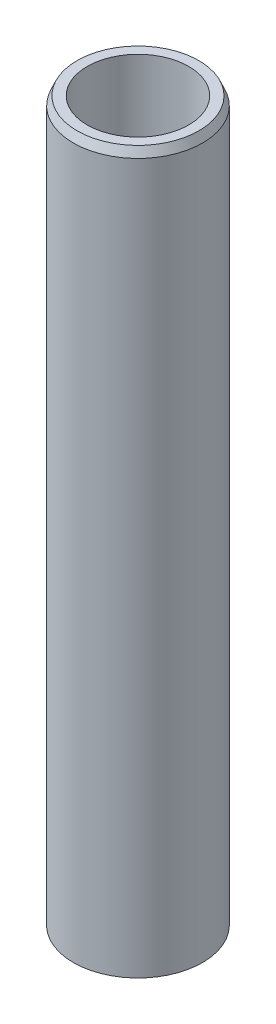
ISO-10303-21;
HEADER;
FILE_DESCRIPTION(('STEP AP214'),'2;1');
FILE_NAME('part.step','',(''),(''),'','','');
FILE_SCHEMA(('AUTOMOTIVE_DESIGN { 1 0 10303 214 1 1 1 1 }'));
ENDSEC;
DATA;
#1=APPLICATION_CONTEXT('core data for automotive mechanical design processes');
#2=APPLICATION_PROTOCOL_DEFINITION('international standard','automotive_design',2000,#1);
#3=PRODUCT_CONTEXT('',#1,'mechanical');
#4=PRODUCT('Part','Part','',(#3));
#5=PRODUCT_RELATED_PRODUCT_CATEGORY('part','',(#4));
#6=PRODUCT_DEFINITION_FORMATION('','',#4);
#7=PRODUCT_DEFINITION_CONTEXT('part definition',#1,'design');
#8=PRODUCT_DEFINITION('design','',#6,#7);
#9=PRODUCT_DEFINITION_SHAPE('','',#8);
#10=(LENGTH_UNIT() NAMED_UNIT(*) SI_UNIT(.MILLI.,.METRE.));
#11=(NAMED_UNIT(*) PLANE_ANGLE_UNIT() SI_UNIT($,.RADIAN.));
#12=(NAMED_UNIT(*) SI_UNIT($,.STERADIAN.) SOLID_ANGLE_UNIT());
#13=UNCERTAINTY_MEASURE_WITH_UNIT(LENGTH_MEASURE(1.E-05),#10,'distance_accuracy_value','');
#14=(GEOMETRIC_REPRESENTATION_CONTEXT(3) GLOBAL_UNCERTAINTY_ASSIGNED_CONTEXT((#13)) GLOBAL_UNIT_ASSIGNED_CONTEXT((#10,
#11,#12)) REPRESENTATION_CONTEXT('',''));
#15=CARTESIAN_POINT('',(0.,0.,0.));
#16=DIRECTION('',(0.,0.,1.));
#17=DIRECTION('',(1.,0.,0.));
#18=AXIS2_PLACEMENT_3D('',#15,#16,#17);
#19=CARTESIAN_POINT('',(0.,363.210754450631,0.));
#20=DIRECTION('',(0.,-1.,0.));
#21=DIRECTION('',(0.,0.,-1.));
#22=AXIS2_PLACEMENT_3D('',#19,#20,#21);
#23=CYLINDRICAL_SURFACE('',#22,32.5);
#24=CARTESIAN_POINT('',(0.,358.850264378254,0.));
#25=DIRECTION('',(0.,1.,0.));
#26=DIRECTION('',(0.,0.,1.));
#27=AXIS2_PLACEMENT_3D('',#24,#25,#26);
#28=CIRCLE('',#27,32.5);
#29=CARTESIAN_POINT('',(0.,358.850264378254,32.5));
#30=VERTEX_POINT('',#29);
#31=EDGE_CURVE('E50',#30,#30,#28,.F.);
#32=ORIENTED_EDGE('',*,*,#31,.T.);
#33=EDGE_LOOP('',(#32));
#34=FACE_BOUND('',#33,.T.);
#35=CARTESIAN_POINT('',(0.,1.88563573344724,0.));
#36=DIRECTION('',(0.,1.,0.));
#37=DIRECTION('',(0.,0.,1.));
#38=AXIS2_PLACEMENT_3D('',#35,#36,#37);
#39=CIRCLE('',#38,32.5);
#40=CARTESIAN_POINT('',(0.,1.88563573344724,32.5));
#41=VERTEX_POINT('',#40);
#42=EDGE_CURVE('E51',#41,#41,#39,.T.);
#43=ORIENTED_EDGE('',*,*,#42,.T.);
#44=EDGE_LOOP('',(#43));
#45=FACE_BOUND('',#44,.T.);
#46=ADVANCED_FACE('F39',(#34,#45),#23,.T.);
#47=CARTESIAN_POINT('',(0.,363.210754450631,0.));
#48=DIRECTION('',(0.,1.,0.));
#49=DIRECTION('',(0.,0.,1.));
#50=AXIS2_PLACEMENT_3D('',#47,#48,#49);
#51=PLANE('',#50);
#52=CARTESIAN_POINT('',(0.,363.210754450631,0.));
#53=DIRECTION('',(0.,1.,0.));
#54=DIRECTION('',(0.,0.,1.));
#55=AXIS2_PLACEMENT_3D('',#52,#53,#54);
#56=CIRCLE('',#55,30.6143642665529);
#57=CARTESIAN_POINT('',(0.,363.210754450631,30.6143642665529));
#58=VERTEX_POINT('',#57);
#59=EDGE_CURVE('E54',#58,#58,#56,.T.);
#60=ORIENTED_EDGE('',*,*,#59,.T.);
#61=EDGE_LOOP('',(#60));
#62=FACE_BOUND('',#61,.T.);
#63=CARTESIAN_POINT('',(0.,363.210754450631,0.));
#64=DIRECTION('',(0.,1.,0.));
#65=DIRECTION('',(0.,0.,1.));
#66=AXIS2_PLACEMENT_3D('',#63,#64,#65);
#67=CIRCLE('',#66,25.5269084110708);
#68=CARTESIAN_POINT('',(0.,363.210754450631,25.5269084110708));
#69=VERTEX_POINT('',#68);
#70=EDGE_CURVE('E58',#69,#69,#67,.T.);
#71=ORIENTED_EDGE('',*,*,#70,.F.);
#72=EDGE_LOOP('',(#71));
#73=FACE_BOUND('',#72,.T.);
#74=ADVANCED_FACE('F69',(#62,#73),#51,.T.);
#75=CARTESIAN_POINT('',(0.,0.,0.));
#76=DIRECTION('',(0.,1.,0.));
#77=DIRECTION('',(0.,0.,1.));
#78=AXIS2_PLACEMENT_3D('',#75,#76,#77);
#79=PLANE('',#78);
#80=CARTESIAN_POINT('',(0.,0.,0.));
#81=DIRECTION('',(0.,1.,0.));
#82=DIRECTION('',(0.,0.,1.));
#83=AXIS2_PLACEMENT_3D('',#80,#81,#82);
#84=CIRCLE('',#83,28.1395099276222);
#85=CARTESIAN_POINT('',(0.,0.,28.1395099276222));
#86=VERTEX_POINT('',#85);
#87=EDGE_CURVE('E10',#86,#86,#84,.F.);
#88=ORIENTED_EDGE('',*,*,#87,.T.);
#89=EDGE_LOOP('',(#88));
#90=FACE_BOUND('',#89,.T.);
#91=CARTESIAN_POINT('',(0.,0.,0.));
#92=DIRECTION('',(0.,1.,0.));
#93=DIRECTION('',(0.,0.,1.));
#94=AXIS2_PLACEMENT_3D('',#91,#92,#93);
#95=CIRCLE('',#94,25.5269084110708);
#96=CARTESIAN_POINT('',(0.,0.,25.5269084110708));
#97=VERTEX_POINT('',#96);
#98=EDGE_CURVE('E63',#97,#97,#95,.T.);
#99=ORIENTED_EDGE('',*,*,#98,.T.);
#100=EDGE_LOOP('',(#99));
#101=FACE_BOUND('',#100,.T.);
#102=ADVANCED_FACE('F75',(#90,#101),#79,.F.);
#103=CARTESIAN_POINT('',(0.,363.210754450631,0.));
#104=DIRECTION('',(0.,-1.,0.));
#105=DIRECTION('',(0.,0.,-1.));
#106=AXIS2_PLACEMENT_3D('',#103,#104,#105);
#107=CYLINDRICAL_SURFACE('',#106,25.5269084110708);
#108=ORIENTED_EDGE('',*,*,#70,.T.);
#109=EDGE_LOOP('',(#108));
#110=FACE_BOUND('',#109,.T.);
#111=ORIENTED_EDGE('',*,*,#98,.F.);
#112=EDGE_LOOP('',(#111));
#113=FACE_BOUND('',#112,.T.);
#114=ADVANCED_FACE('F70',(#110,#113),#107,.F.);
#115=CARTESIAN_POINT('',(0.,363.210754450631,0.));
#116=DIRECTION('',(0.,-1.,0.));
#117=DIRECTION('',(0.,0.,-1.));
#118=AXIS2_PLACEMENT_3D('',#115,#116,#117);
#119=CONICAL_SURFACE('',#118,30.6143642665529,0.408152659629621);
#120=ORIENTED_EDGE('',*,*,#31,.F.);
#121=EDGE_LOOP('',(#120));
#122=FACE_BOUND('',#121,.T.);
#123=ORIENTED_EDGE('',*,*,#59,.F.);
#124=EDGE_LOOP('',(#123));
#125=FACE_BOUND('',#124,.T.);
#126=ADVANCED_FACE('F81',(#122,#125),#119,.T.);
#127=CARTESIAN_POINT('',(0.,1.88563573344724,0.));
#128=DIRECTION('',(0.,1.,0.));
#129=DIRECTION('',(0.,0.,1.));
#130=AXIS2_PLACEMENT_3D('',#127,#128,#129);
#131=CONICAL_SURFACE('',#130,32.5,1.16264366716527);
#132=ORIENTED_EDGE('',*,*,#87,.F.);
#133=EDGE_LOOP('',(#132));
#134=FACE_BOUND('',#133,.T.);
#135=ORIENTED_EDGE('',*,*,#42,.F.);
#136=EDGE_LOOP('',(#135));
#137=FACE_BOUND('',#136,.T.);
#138=ADVANCED_FACE('F45',(#134,#137),#131,.T.);
#139=CLOSED_SHELL('',(#46,#74,#102,#114,#126,#138));
#140=MANIFOLD_SOLID_BREP('B2',#139);
#141=ADVANCED_BREP_SHAPE_REPRESENTATION('',(#18,#140),#14);
#142=SHAPE_DEFINITION_REPRESENTATION(#9,#141);
ENDSEC;
END-ISO-10303-21;
